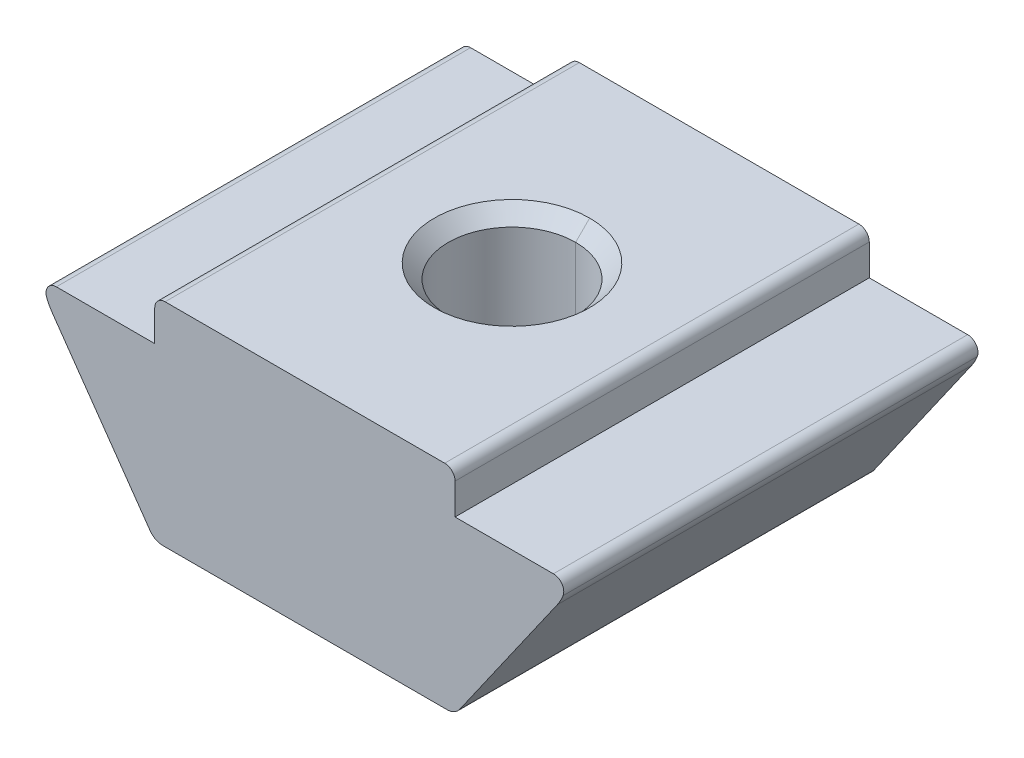
ISO-10303-21;
HEADER;
FILE_DESCRIPTION(('STEP AP214'),'2;1');
FILE_NAME('part.step','',(''),(''),'','','');
FILE_SCHEMA(('AUTOMOTIVE_DESIGN { 1 0 10303 214 1 1 1 1 }'));
ENDSEC;
DATA;
#1=APPLICATION_CONTEXT('core data for automotive mechanical design processes');
#2=APPLICATION_PROTOCOL_DEFINITION('international standard','automotive_design',2000,#1);
#3=PRODUCT_CONTEXT('',#1,'mechanical');
#4=PRODUCT('Part','Part','',(#3));
#5=PRODUCT_RELATED_PRODUCT_CATEGORY('part','',(#4));
#6=PRODUCT_DEFINITION_FORMATION('','',#4);
#7=PRODUCT_DEFINITION_CONTEXT('part definition',#1,'design');
#8=PRODUCT_DEFINITION('design','',#6,#7);
#9=PRODUCT_DEFINITION_SHAPE('','',#8);
#10=(LENGTH_UNIT() NAMED_UNIT(*) SI_UNIT(.MILLI.,.METRE.));
#11=(NAMED_UNIT(*) PLANE_ANGLE_UNIT() SI_UNIT($,.RADIAN.));
#12=(NAMED_UNIT(*) SI_UNIT($,.STERADIAN.) SOLID_ANGLE_UNIT());
#13=UNCERTAINTY_MEASURE_WITH_UNIT(LENGTH_MEASURE(1.E-05),#10,'distance_accuracy_value','');
#14=(GEOMETRIC_REPRESENTATION_CONTEXT(3) GLOBAL_UNCERTAINTY_ASSIGNED_CONTEXT((#13)) GLOBAL_UNIT_ASSIGNED_CONTEXT((#10,
#11,#12)) REPRESENTATION_CONTEXT('',''));
#15=CARTESIAN_POINT('',(0.,0.,0.));
#16=DIRECTION('',(0.,0.,1.));
#17=DIRECTION('',(1.,0.,0.));
#18=AXIS2_PLACEMENT_3D('',#15,#16,#17);
#19=CARTESIAN_POINT('',(-2.9,3.3,8.));
#20=DIRECTION('',(0.,-1.,0.));
#21=DIRECTION('',(0.,0.,-1.));
#22=AXIS2_PLACEMENT_3D('',#19,#20,#21);
#23=PLANE('',#22);
#24=DIRECTION('',(-1.,0.,0.));
#25=VECTOR('',#24,1.);
#26=CARTESIAN_POINT('',(-2.9,3.3,0.));
#27=LINE('',#26,#25);
#28=CARTESIAN_POINT('',(-2.9,3.3,0.));
#29=VERTEX_POINT('',#28);
#30=CARTESIAN_POINT('',(-4.7998662157511,3.3,0.));
#31=VERTEX_POINT('',#30);
#32=EDGE_CURVE('E11',#29,#31,#27,.T.);
#33=ORIENTED_EDGE('',*,*,#32,.T.);
#34=DIRECTION('',(0.,0.,-1.));
#35=VECTOR('',#34,1.);
#36=CARTESIAN_POINT('',(-4.7998662157511,3.3,8.));
#37=LINE('',#36,#35);
#38=CARTESIAN_POINT('',(-4.7998662157511,3.3,8.));
#39=VERTEX_POINT('',#38);
#40=EDGE_CURVE('E25',#39,#31,#37,.T.);
#41=ORIENTED_EDGE('',*,*,#40,.F.);
#42=DIRECTION('',(-1.,0.,0.));
#43=VECTOR('',#42,1.);
#44=CARTESIAN_POINT('',(-2.9,3.3,8.));
#45=LINE('',#44,#43);
#46=CARTESIAN_POINT('',(-2.9,3.3,8.));
#47=VERTEX_POINT('',#46);
#48=EDGE_CURVE('E407',#47,#39,#45,.T.);
#49=ORIENTED_EDGE('',*,*,#48,.F.);
#50=DIRECTION('',(0.,0.,-1.));
#51=VECTOR('',#50,1.);
#52=CARTESIAN_POINT('',(-2.9,3.3,8.));
#53=LINE('',#52,#51);
#54=EDGE_CURVE('E403',#47,#29,#53,.T.);
#55=ORIENTED_EDGE('',*,*,#54,.T.);
#56=EDGE_LOOP('',(#33,#41,#49,#55));
#57=FACE_BOUND('',#56,.T.);
#58=ADVANCED_FACE('F17',(#57),#23,.F.);
#59=CARTESIAN_POINT('',(-2.9,3.9,8.));
#60=DIRECTION('',(1.,0.,0.));
#61=DIRECTION('',(0.,0.,-1.));
#62=AXIS2_PLACEMENT_3D('',#59,#60,#61);
#63=PLANE('',#62);
#64=DIRECTION('',(0.,-1.,0.));
#65=VECTOR('',#64,1.);
#66=CARTESIAN_POINT('',(-2.9,3.9,0.));
#67=LINE('',#66,#65);
#68=CARTESIAN_POINT('',(-2.9,3.9,0.));
#69=VERTEX_POINT('',#68);
#70=EDGE_CURVE('E398',#69,#29,#67,.T.);
#71=ORIENTED_EDGE('',*,*,#70,.T.);
#72=ORIENTED_EDGE('',*,*,#54,.F.);
#73=DIRECTION('',(0.,-1.,0.));
#74=VECTOR('',#73,1.);
#75=CARTESIAN_POINT('',(-2.9,3.9,8.));
#76=LINE('',#75,#74);
#77=CARTESIAN_POINT('',(-2.9,3.9,8.));
#78=VERTEX_POINT('',#77);
#79=EDGE_CURVE('E393',#78,#47,#76,.T.);
#80=ORIENTED_EDGE('',*,*,#79,.F.);
#81=DIRECTION('',(0.,0.,-1.));
#82=VECTOR('',#81,1.);
#83=CARTESIAN_POINT('',(-2.9,3.9,8.));
#84=LINE('',#83,#82);
#85=EDGE_CURVE('E389',#78,#69,#84,.T.);
#86=ORIENTED_EDGE('',*,*,#85,.T.);
#87=EDGE_LOOP('',(#71,#72,#80,#86));
#88=FACE_BOUND('',#87,.T.);
#89=ADVANCED_FACE('F424',(#88),#63,.F.);
#90=CARTESIAN_POINT('',(-2.7,3.9,8.));
#91=DIRECTION('',(0.,0.,-1.));
#92=DIRECTION('',(0.707106781186548,-0.707106781186547,0.));
#93=AXIS2_PLACEMENT_3D('',#90,#91,#92);
#94=CYLINDRICAL_SURFACE('',#93,0.20000000000003);
#95=CARTESIAN_POINT('',(-2.7,3.9,0.));
#96=DIRECTION('',(0.,0.,1.));
#97=DIRECTION('',(1.,0.,0.));
#98=AXIS2_PLACEMENT_3D('',#95,#96,#97);
#99=CIRCLE('',#98,0.20000000000003);
#100=CARTESIAN_POINT('',(-2.7,4.1,0.));
#101=VERTEX_POINT('',#100);
#102=EDGE_CURVE('E384',#101,#69,#99,.T.);
#103=ORIENTED_EDGE('',*,*,#102,.T.);
#104=ORIENTED_EDGE('',*,*,#85,.F.);
#105=CARTESIAN_POINT('',(-2.7,3.9,8.));
#106=DIRECTION('',(0.,0.,1.));
#107=DIRECTION('',(1.,0.,0.));
#108=AXIS2_PLACEMENT_3D('',#105,#106,#107);
#109=CIRCLE('',#108,0.20000000000003);
#110=CARTESIAN_POINT('',(-2.7,4.1,8.));
#111=VERTEX_POINT('',#110);
#112=EDGE_CURVE('E379',#111,#78,#109,.T.);
#113=ORIENTED_EDGE('',*,*,#112,.F.);
#114=DIRECTION('',(0.,0.,-1.));
#115=VECTOR('',#114,1.);
#116=CARTESIAN_POINT('',(-2.7,4.1,8.));
#117=LINE('',#116,#115);
#118=EDGE_CURVE('E375',#111,#101,#117,.T.);
#119=ORIENTED_EDGE('',*,*,#118,.T.);
#120=EDGE_LOOP('',(#103,#104,#113,#119));
#121=FACE_BOUND('',#120,.T.);
#122=ADVANCED_FACE('F478',(#121),#94,.T.);
#123=CARTESIAN_POINT('',(2.7,4.1,8.));
#124=DIRECTION('',(0.,-1.,0.));
#125=DIRECTION('',(0.,0.,-1.));
#126=AXIS2_PLACEMENT_3D('',#123,#124,#125);
#127=PLANE('',#126);
#128=CARTESIAN_POINT('',(0.,4.1,4.));
#129=DIRECTION('',(0.,1.,0.));
#130=DIRECTION('',(0.,0.,1.));
#131=AXIS2_PLACEMENT_3D('',#128,#129,#130);
#132=CIRCLE('',#131,1.5);
#133=CARTESIAN_POINT('',(0.,4.1,2.5));
#134=VERTEX_POINT('',#133);
#135=CARTESIAN_POINT('',(0.,4.1,5.5));
#136=VERTEX_POINT('',#135);
#137=EDGE_CURVE('E161',#134,#136,#132,.T.);
#138=ORIENTED_EDGE('',*,*,#137,.F.);
#139=CARTESIAN_POINT('',(0.,4.1,4.));
#140=DIRECTION('',(0.,1.,0.));
#141=DIRECTION('',(0.,0.,1.));
#142=AXIS2_PLACEMENT_3D('',#139,#140,#141);
#143=CIRCLE('',#142,1.5);
#144=EDGE_CURVE('E368',#136,#134,#143,.T.);
#145=ORIENTED_EDGE('',*,*,#144,.F.);
#146=EDGE_LOOP('',(#138,#145));
#147=FACE_BOUND('',#146,.T.);
#148=DIRECTION('',(-1.,0.,0.));
#149=VECTOR('',#148,1.);
#150=CARTESIAN_POINT('',(2.7,4.1,0.));
#151=LINE('',#150,#149);
#152=CARTESIAN_POINT('',(2.7,4.1,0.));
#153=VERTEX_POINT('',#152);
#154=EDGE_CURVE('E363',#153,#101,#151,.T.);
#155=ORIENTED_EDGE('',*,*,#154,.T.);
#156=ORIENTED_EDGE('',*,*,#118,.F.);
#157=DIRECTION('',(-1.,0.,0.));
#158=VECTOR('',#157,1.);
#159=CARTESIAN_POINT('',(2.7,4.1,8.));
#160=LINE('',#159,#158);
#161=CARTESIAN_POINT('',(2.7,4.1,8.));
#162=VERTEX_POINT('',#161);
#163=EDGE_CURVE('E358',#162,#111,#160,.T.);
#164=ORIENTED_EDGE('',*,*,#163,.F.);
#165=DIRECTION('',(0.,0.,-1.));
#166=VECTOR('',#165,1.);
#167=CARTESIAN_POINT('',(2.7,4.1,8.));
#168=LINE('',#167,#166);
#169=EDGE_CURVE('E354',#162,#153,#168,.T.);
#170=ORIENTED_EDGE('',*,*,#169,.T.);
#171=EDGE_LOOP('',(#155,#156,#164,#170));
#172=FACE_BOUND('',#171,.T.);
#173=ADVANCED_FACE('F475',(#147,#172),#127,.F.);
#174=CARTESIAN_POINT('',(2.7,3.9,8.));
#175=DIRECTION('',(0.,0.,-1.));
#176=DIRECTION('',(-0.707106781186548,-0.707106781186547,0.));
#177=AXIS2_PLACEMENT_3D('',#174,#175,#176);
#178=CYLINDRICAL_SURFACE('',#177,0.200000000000031);
#179=CARTESIAN_POINT('',(2.7,3.9,0.));
#180=DIRECTION('',(0.,0.,1.));
#181=DIRECTION('',(1.,0.,0.));
#182=AXIS2_PLACEMENT_3D('',#179,#180,#181);
#183=CIRCLE('',#182,0.200000000000031);
#184=CARTESIAN_POINT('',(2.9,3.9,0.));
#185=VERTEX_POINT('',#184);
#186=EDGE_CURVE('E349',#185,#153,#183,.T.);
#187=ORIENTED_EDGE('',*,*,#186,.T.);
#188=ORIENTED_EDGE('',*,*,#169,.F.);
#189=CARTESIAN_POINT('',(2.7,3.9,8.));
#190=DIRECTION('',(0.,0.,1.));
#191=DIRECTION('',(1.,0.,0.));
#192=AXIS2_PLACEMENT_3D('',#189,#190,#191);
#193=CIRCLE('',#192,0.200000000000031);
#194=CARTESIAN_POINT('',(2.9,3.9,8.));
#195=VERTEX_POINT('',#194);
#196=EDGE_CURVE('E344',#195,#162,#193,.T.);
#197=ORIENTED_EDGE('',*,*,#196,.F.);
#198=DIRECTION('',(0.,0.,-1.));
#199=VECTOR('',#198,1.);
#200=CARTESIAN_POINT('',(2.9,3.9,8.));
#201=LINE('',#200,#199);
#202=EDGE_CURVE('E340',#195,#185,#201,.T.);
#203=ORIENTED_EDGE('',*,*,#202,.T.);
#204=EDGE_LOOP('',(#187,#188,#197,#203));
#205=FACE_BOUND('',#204,.T.);
#206=ADVANCED_FACE('F472',(#205),#178,.T.);
#207=CARTESIAN_POINT('',(2.9,3.3,8.));
#208=DIRECTION('',(-1.,0.,0.));
#209=DIRECTION('',(0.,0.,1.));
#210=AXIS2_PLACEMENT_3D('',#207,#208,#209);
#211=PLANE('',#210);
#212=DIRECTION('',(0.,1.,0.));
#213=VECTOR('',#212,1.);
#214=CARTESIAN_POINT('',(2.9,3.3,0.));
#215=LINE('',#214,#213);
#216=CARTESIAN_POINT('',(2.9,3.3,0.));
#217=VERTEX_POINT('',#216);
#218=EDGE_CURVE('E335',#217,#185,#215,.T.);
#219=ORIENTED_EDGE('',*,*,#218,.T.);
#220=ORIENTED_EDGE('',*,*,#202,.F.);
#221=DIRECTION('',(0.,1.,0.));
#222=VECTOR('',#221,1.);
#223=CARTESIAN_POINT('',(2.9,3.3,8.));
#224=LINE('',#223,#222);
#225=CARTESIAN_POINT('',(2.9,3.3,8.));
#226=VERTEX_POINT('',#225);
#227=EDGE_CURVE('E330',#226,#195,#224,.T.);
#228=ORIENTED_EDGE('',*,*,#227,.F.);
#229=DIRECTION('',(0.,0.,-1.));
#230=VECTOR('',#229,1.);
#231=CARTESIAN_POINT('',(2.9,3.3,8.));
#232=LINE('',#231,#230);
#233=EDGE_CURVE('E326',#226,#217,#232,.T.);
#234=ORIENTED_EDGE('',*,*,#233,.T.);
#235=EDGE_LOOP('',(#219,#220,#228,#234));
#236=FACE_BOUND('',#235,.T.);
#237=ADVANCED_FACE('F467',(#236),#211,.F.);
#238=CARTESIAN_POINT('',(4.7998662157511,3.3,8.));
#239=DIRECTION('',(0.,-1.,0.));
#240=DIRECTION('',(0.,0.,-1.));
#241=AXIS2_PLACEMENT_3D('',#238,#239,#240);
#242=PLANE('',#241);
#243=DIRECTION('',(-1.,0.,0.));
#244=VECTOR('',#243,1.);
#245=CARTESIAN_POINT('',(4.7998662157511,3.3,0.));
#246=LINE('',#245,#244);
#247=CARTESIAN_POINT('',(4.7998662157511,3.3,0.));
#248=VERTEX_POINT('',#247);
#249=EDGE_CURVE('E321',#248,#217,#246,.T.);
#250=ORIENTED_EDGE('',*,*,#249,.T.);
#251=ORIENTED_EDGE('',*,*,#233,.F.);
#252=DIRECTION('',(-1.,0.,0.));
#253=VECTOR('',#252,1.);
#254=CARTESIAN_POINT('',(4.7998662157511,3.3,8.));
#255=LINE('',#254,#253);
#256=CARTESIAN_POINT('',(4.7998662157511,3.3,8.));
#257=VERTEX_POINT('',#256);
#258=EDGE_CURVE('E316',#257,#226,#255,.T.);
#259=ORIENTED_EDGE('',*,*,#258,.F.);
#260=DIRECTION('',(0.,0.,-1.));
#261=VECTOR('',#260,1.);
#262=CARTESIAN_POINT('',(4.7998662157511,3.3,8.));
#263=LINE('',#262,#261);
#264=EDGE_CURVE('E312',#257,#248,#263,.T.);
#265=ORIENTED_EDGE('',*,*,#264,.T.);
#266=EDGE_LOOP('',(#250,#251,#259,#265));
#267=FACE_BOUND('',#266,.T.);
#268=ADVANCED_FACE('F463',(#267),#242,.F.);
#269=CARTESIAN_POINT('',(4.7998662157511,3.10000000000006,8.));
#270=DIRECTION('',(0.,0.,-1.));
#271=DIRECTION('',(-0.827037597866269,-0.562146610516858,0.));
#272=AXIS2_PLACEMENT_3D('',#269,#270,#271);
#273=CYLINDRICAL_SURFACE('',#272,0.199999999999944);
#274=CARTESIAN_POINT('',(4.7998662157511,3.10000000000006,0.));
#275=DIRECTION('',(0.,0.,1.));
#276=DIRECTION('',(1.,0.,0.));
#277=AXIS2_PLACEMENT_3D('',#274,#275,#276);
#278=CIRCLE('',#277,0.199999999999944);
#279=CARTESIAN_POINT('',(4.9858327696888,3.0264035271463,0.));
#280=VERTEX_POINT('',#279);
#281=EDGE_CURVE('E307',#280,#248,#278,.T.);
#282=ORIENTED_EDGE('',*,*,#281,.T.);
#283=ORIENTED_EDGE('',*,*,#264,.F.);
#284=CARTESIAN_POINT('',(4.7998662157511,3.10000000000006,8.));
#285=DIRECTION('',(0.,0.,1.));
#286=DIRECTION('',(1.,0.,0.));
#287=AXIS2_PLACEMENT_3D('',#284,#285,#286);
#288=CIRCLE('',#287,0.199999999999944);
#289=CARTESIAN_POINT('',(4.9858327696888,3.0264035271463,8.));
#290=VERTEX_POINT('',#289);
#291=EDGE_CURVE('E302',#290,#257,#288,.T.);
#292=ORIENTED_EDGE('',*,*,#291,.F.);
#293=DIRECTION('',(0.,0.,-1.));
#294=VECTOR('',#293,1.);
#295=CARTESIAN_POINT('',(4.9858327696888,3.0264035271463,8.));
#296=LINE('',#295,#294);
#297=EDGE_CURVE('E298',#290,#280,#296,.T.);
#298=ORIENTED_EDGE('',*,*,#297,.T.);
#299=EDGE_LOOP('',(#282,#283,#292,#298));
#300=FACE_BOUND('',#299,.T.);
#301=ADVANCED_FACE('F460',(#300),#273,.T.);
#302=CARTESIAN_POINT('',(4.05600000000028,3.39438589141449,8.));
#303=DIRECTION('',(0.,0.,-1.));
#304=DIRECTION('',(-0.880513596901839,0.474020891597602,0.));
#305=AXIS2_PLACEMENT_3D('',#302,#303,#304);
#306=CYLINDRICAL_SURFACE('',#305,0.999999999999519);
#307=CARTESIAN_POINT('',(4.05600000000028,3.39438589141449,0.));
#308=DIRECTION('',(0.,0.,1.));
#309=DIRECTION('',(1.,0.,0.));
#310=AXIS2_PLACEMENT_3D('',#307,#308,#309);
#311=CIRCLE('',#310,0.999999999999519);
#312=CARTESIAN_POINT('',(4.875152044289,2.8208094550639,0.));
#313=VERTEX_POINT('',#312);
#314=EDGE_CURVE('E293',#313,#280,#311,.T.);
#315=ORIENTED_EDGE('',*,*,#314,.T.);
#316=ORIENTED_EDGE('',*,*,#297,.F.);
#317=CARTESIAN_POINT('',(4.05600000000028,3.39438589141449,8.));
#318=DIRECTION('',(0.,0.,1.));
#319=DIRECTION('',(1.,0.,0.));
#320=AXIS2_PLACEMENT_3D('',#317,#318,#319);
#321=CIRCLE('',#320,0.999999999999519);
#322=CARTESIAN_POINT('',(4.875152044289,2.8208094550639,8.));
#323=VERTEX_POINT('',#322);
#324=EDGE_CURVE('E288',#323,#290,#321,.T.);
#325=ORIENTED_EDGE('',*,*,#324,.F.);
#326=DIRECTION('',(0.,0.,-1.));
#327=VECTOR('',#326,1.);
#328=CARTESIAN_POINT('',(4.875152044289,2.8208094550639,8.));
#329=LINE('',#328,#327);
#330=EDGE_CURVE('E284',#323,#313,#329,.T.);
#331=ORIENTED_EDGE('',*,*,#330,.T.);
#332=EDGE_LOOP('',(#315,#316,#325,#331));
#333=FACE_BOUND('',#332,.T.);
#334=ADVANCED_FACE('F455',(#333),#306,.T.);
#335=CARTESIAN_POINT('',(2.9895754981212,0.12792706909469,8.));
#336=DIRECTION('',(-0.819152044288991,0.573576436351048,0.));
#337=DIRECTION('',(-0.573576436351048,-0.819152044288991,0.));
#338=AXIS2_PLACEMENT_3D('',#335,#336,#337);
#339=PLANE('',#338);
#340=DIRECTION('',(0.573576436351048,0.81915204428899,0.));
#341=VECTOR('',#340,1.);
#342=CARTESIAN_POINT('',(2.9895754981212,0.12792706909469,0.));
#343=LINE('',#342,#341);
#344=CARTESIAN_POINT('',(2.9895754981212,0.12792706909469,0.));
#345=VERTEX_POINT('',#344);
#346=EDGE_CURVE('E279',#345,#313,#343,.T.);
#347=ORIENTED_EDGE('',*,*,#346,.T.);
#348=ORIENTED_EDGE('',*,*,#330,.F.);
#349=DIRECTION('',(0.573576436351048,0.81915204428899,0.));
#350=VECTOR('',#349,1.);
#351=CARTESIAN_POINT('',(2.9895754981212,0.12792706909469,8.));
#352=LINE('',#351,#350);
#353=CARTESIAN_POINT('',(2.9895754981212,0.12792706909469,8.));
#354=VERTEX_POINT('',#353);
#355=EDGE_CURVE('E274',#354,#323,#352,.T.);
#356=ORIENTED_EDGE('',*,*,#355,.F.);
#357=DIRECTION('',(0.,0.,-1.));
#358=VECTOR('',#357,1.);
#359=CARTESIAN_POINT('',(2.9895754981212,0.12792706909469,8.));
#360=LINE('',#359,#358);
#361=EDGE_CURVE('E270',#354,#345,#360,.T.);
#362=ORIENTED_EDGE('',*,*,#361,.T.);
#363=EDGE_LOOP('',(#347,#348,#356,#362));
#364=FACE_BOUND('',#363,.T.);
#365=ADVANCED_FACE('F452',(#364),#339,.F.);
#366=CARTESIAN_POINT('',(2.74382988483448,0.300000000000038,8.));
#367=DIRECTION('',(0.,0.,-1.));
#368=DIRECTION('',(-0.461748613235041,0.887010833178218,0.));
#369=AXIS2_PLACEMENT_3D('',#366,#367,#368);
#370=CYLINDRICAL_SURFACE('',#369,0.300000000000038);
#371=CARTESIAN_POINT('',(2.74382988483448,0.300000000000038,0.));
#372=DIRECTION('',(0.,0.,1.));
#373=DIRECTION('',(1.,0.,0.));
#374=AXIS2_PLACEMENT_3D('',#371,#372,#373);
#375=CIRCLE('',#374,0.300000000000038);
#376=CARTESIAN_POINT('',(2.7438298848345,0.,0.));
#377=VERTEX_POINT('',#376);
#378=EDGE_CURVE('E265',#377,#345,#375,.T.);
#379=ORIENTED_EDGE('',*,*,#378,.T.);
#380=ORIENTED_EDGE('',*,*,#361,.F.);
#381=CARTESIAN_POINT('',(2.74382988483448,0.300000000000038,8.));
#382=DIRECTION('',(0.,0.,1.));
#383=DIRECTION('',(1.,0.,0.));
#384=AXIS2_PLACEMENT_3D('',#381,#382,#383);
#385=CIRCLE('',#384,0.300000000000038);
#386=CARTESIAN_POINT('',(2.7438298848345,0.,8.));
#387=VERTEX_POINT('',#386);
#388=EDGE_CURVE('E260',#387,#354,#385,.T.);
#389=ORIENTED_EDGE('',*,*,#388,.F.);
#390=DIRECTION('',(0.,0.,-1.));
#391=VECTOR('',#390,1.);
#392=CARTESIAN_POINT('',(2.7438298848345,0.,8.));
#393=LINE('',#392,#391);
#394=EDGE_CURVE('E256',#387,#377,#393,.T.);
#395=ORIENTED_EDGE('',*,*,#394,.T.);
#396=EDGE_LOOP('',(#379,#380,#389,#395));
#397=FACE_BOUND('',#396,.T.);
#398=ADVANCED_FACE('F449',(#397),#370,.T.);
#399=CARTESIAN_POINT('',(-2.7438298848345,0.,8.));
#400=DIRECTION('',(0.,1.,0.));
#401=DIRECTION('',(0.,0.,1.));
#402=AXIS2_PLACEMENT_3D('',#399,#400,#401);
#403=PLANE('',#402);
#404=CARTESIAN_POINT('',(0.,0.,4.));
#405=DIRECTION('',(0.,1.,0.));
#406=DIRECTION('',(0.,0.,1.));
#407=AXIS2_PLACEMENT_3D('',#404,#405,#406);
#408=CIRCLE('',#407,1.2295);
#409=CARTESIAN_POINT('',(0.,0.,5.2295));
#410=VERTEX_POINT('',#409);
#411=CARTESIAN_POINT('',(0.,0.,2.7705));
#412=VERTEX_POINT('',#411);
#413=EDGE_CURVE('E173',#410,#412,#408,.T.);
#414=ORIENTED_EDGE('',*,*,#413,.T.);
#415=CARTESIAN_POINT('',(0.,0.,4.));
#416=DIRECTION('',(0.,1.,0.));
#417=DIRECTION('',(0.,0.,1.));
#418=AXIS2_PLACEMENT_3D('',#415,#416,#417);
#419=CIRCLE('',#418,1.2295);
#420=EDGE_CURVE('E249',#412,#410,#419,.T.);
#421=ORIENTED_EDGE('',*,*,#420,.T.);
#422=EDGE_LOOP('',(#414,#421));
#423=FACE_BOUND('',#422,.T.);
#424=DIRECTION('',(1.,0.,0.));
#425=VECTOR('',#424,1.);
#426=CARTESIAN_POINT('',(-2.7438298848345,0.,0.));
#427=LINE('',#426,#425);
#428=CARTESIAN_POINT('',(-2.7438298848345,0.,0.));
#429=VERTEX_POINT('',#428);
#430=EDGE_CURVE('E244',#429,#377,#427,.T.);
#431=ORIENTED_EDGE('',*,*,#430,.T.);
#432=ORIENTED_EDGE('',*,*,#394,.F.);
#433=DIRECTION('',(1.,0.,0.));
#434=VECTOR('',#433,1.);
#435=CARTESIAN_POINT('',(-2.7438298848345,0.,8.));
#436=LINE('',#435,#434);
#437=CARTESIAN_POINT('',(-2.7438298848345,0.,8.));
#438=VERTEX_POINT('',#437);
#439=EDGE_CURVE('E239',#438,#387,#436,.T.);
#440=ORIENTED_EDGE('',*,*,#439,.F.);
#441=DIRECTION('',(0.,0.,-1.));
#442=VECTOR('',#441,1.);
#443=CARTESIAN_POINT('',(-2.7438298848345,0.,8.));
#444=LINE('',#443,#442);
#445=EDGE_CURVE('E235',#438,#429,#444,.T.);
#446=ORIENTED_EDGE('',*,*,#445,.T.);
#447=EDGE_LOOP('',(#431,#432,#440,#446));
#448=FACE_BOUND('',#447,.T.);
#449=ADVANCED_FACE('F443',(#423,#448),#403,.F.);
#450=CARTESIAN_POINT('',(-2.74382988483449,0.300000000000032,8.));
#451=DIRECTION('',(0.,0.,-1.));
#452=DIRECTION('',(0.461748613235037,0.88701083317822,0.));
#453=AXIS2_PLACEMENT_3D('',#450,#451,#452);
#454=CYLINDRICAL_SURFACE('',#453,0.300000000000032);
#455=CARTESIAN_POINT('',(-2.74382988483449,0.300000000000032,0.));
#456=DIRECTION('',(0.,0.,1.));
#457=DIRECTION('',(1.,0.,0.));
#458=AXIS2_PLACEMENT_3D('',#455,#456,#457);
#459=CIRCLE('',#458,0.300000000000032);
#460=CARTESIAN_POINT('',(-2.9895754981212,0.12792706909469,0.));
#461=VERTEX_POINT('',#460);
#462=EDGE_CURVE('E230',#461,#429,#459,.T.);
#463=ORIENTED_EDGE('',*,*,#462,.T.);
#464=ORIENTED_EDGE('',*,*,#445,.F.);
#465=CARTESIAN_POINT('',(-2.74382988483449,0.300000000000032,8.));
#466=DIRECTION('',(0.,0.,1.));
#467=DIRECTION('',(1.,0.,0.));
#468=AXIS2_PLACEMENT_3D('',#465,#466,#467);
#469=CIRCLE('',#468,0.300000000000032);
#470=CARTESIAN_POINT('',(-2.9895754981212,0.12792706909469,8.));
#471=VERTEX_POINT('',#470);
#472=EDGE_CURVE('E225',#471,#438,#469,.T.);
#473=ORIENTED_EDGE('',*,*,#472,.F.);
#474=DIRECTION('',(0.,0.,-1.));
#475=VECTOR('',#474,1.);
#476=CARTESIAN_POINT('',(-2.9895754981212,0.12792706909469,8.));
#477=LINE('',#476,#475);
#478=EDGE_CURVE('E221',#471,#461,#477,.T.);
#479=ORIENTED_EDGE('',*,*,#478,.T.);
#480=EDGE_LOOP('',(#463,#464,#473,#479));
#481=FACE_BOUND('',#480,.T.);
#482=ADVANCED_FACE('F440',(#481),#454,.T.);
#483=CARTESIAN_POINT('',(-4.875152044289,2.8208094550639,8.));
#484=DIRECTION('',(0.819152044288991,0.573576436351048,0.));
#485=DIRECTION('',(-0.573576436351048,0.819152044288991,0.));
#486=AXIS2_PLACEMENT_3D('',#483,#484,#485);
#487=PLANE('',#486);
#488=DIRECTION('',(0.573576436351048,-0.81915204428899,0.));
#489=VECTOR('',#488,1.);
#490=CARTESIAN_POINT('',(-4.875152044289,2.8208094550639,0.));
#491=LINE('',#490,#489);
#492=CARTESIAN_POINT('',(-4.875152044289,2.8208094550639,0.));
#493=VERTEX_POINT('',#492);
#494=EDGE_CURVE('E216',#493,#461,#491,.T.);
#495=ORIENTED_EDGE('',*,*,#494,.T.);
#496=ORIENTED_EDGE('',*,*,#478,.F.);
#497=DIRECTION('',(0.573576436351048,-0.81915204428899,0.));
#498=VECTOR('',#497,1.);
#499=CARTESIAN_POINT('',(-4.875152044289,2.8208094550639,8.));
#500=LINE('',#499,#498);
#501=CARTESIAN_POINT('',(-4.875152044289,2.8208094550639,8.));
#502=VERTEX_POINT('',#501);
#503=EDGE_CURVE('E211',#502,#471,#500,.T.);
#504=ORIENTED_EDGE('',*,*,#503,.F.);
#505=DIRECTION('',(0.,0.,-1.));
#506=VECTOR('',#505,1.);
#507=CARTESIAN_POINT('',(-4.875152044289,2.8208094550639,8.));
#508=LINE('',#507,#506);
#509=EDGE_CURVE('E207',#502,#493,#508,.T.);
#510=ORIENTED_EDGE('',*,*,#509,.T.);
#511=EDGE_LOOP('',(#495,#496,#504,#510));
#512=FACE_BOUND('',#511,.T.);
#513=ADVANCED_FACE('F438',(#512),#487,.F.);
#514=CARTESIAN_POINT('',(-4.05600000000028,3.39438589141449,8.));
#515=DIRECTION('',(0.,0.,-1.));
#516=DIRECTION('',(0.880513596901123,0.474020891598932,0.));
#517=AXIS2_PLACEMENT_3D('',#514,#515,#516);
#518=CYLINDRICAL_SURFACE('',#517,0.999999999999519);
#519=CARTESIAN_POINT('',(-4.05600000000028,3.39438589141449,0.));
#520=DIRECTION('',(0.,0.,1.));
#521=DIRECTION('',(1.,0.,0.));
#522=AXIS2_PLACEMENT_3D('',#519,#520,#521);
#523=CIRCLE('',#522,0.999999999999519);
#524=CARTESIAN_POINT('',(-4.9858327696888,3.0264035271463,0.));
#525=VERTEX_POINT('',#524);
#526=EDGE_CURVE('E202',#525,#493,#523,.T.);
#527=ORIENTED_EDGE('',*,*,#526,.T.);
#528=ORIENTED_EDGE('',*,*,#509,.F.);
#529=CARTESIAN_POINT('',(-4.05600000000028,3.39438589141449,8.));
#530=DIRECTION('',(0.,0.,1.));
#531=DIRECTION('',(1.,0.,0.));
#532=AXIS2_PLACEMENT_3D('',#529,#530,#531);
#533=CIRCLE('',#532,0.999999999999519);
#534=CARTESIAN_POINT('',(-4.9858327696888,3.0264035271463,8.));
#535=VERTEX_POINT('',#534);
#536=EDGE_CURVE('E197',#535,#502,#533,.T.);
#537=ORIENTED_EDGE('',*,*,#536,.F.);
#538=DIRECTION('',(0.,0.,-1.));
#539=VECTOR('',#538,1.);
#540=CARTESIAN_POINT('',(-4.9858327696888,3.0264035271463,8.));
#541=LINE('',#540,#539);
#542=EDGE_CURVE('E193',#535,#525,#541,.T.);
#543=ORIENTED_EDGE('',*,*,#542,.T.);
#544=EDGE_LOOP('',(#527,#528,#537,#543));
#545=FACE_BOUND('',#544,.T.);
#546=ADVANCED_FACE('F434',(#545),#518,.T.);
#547=CARTESIAN_POINT('',(-4.7998662157511,3.10000000000006,8.));
#548=DIRECTION('',(0.,0.,-1.));
#549=DIRECTION('',(0.82703759786627,-0.562146610516857,0.));
#550=AXIS2_PLACEMENT_3D('',#547,#548,#549);
#551=CYLINDRICAL_SURFACE('',#550,0.199999999999944);
#552=CARTESIAN_POINT('',(-4.7998662157511,3.10000000000006,0.));
#553=DIRECTION('',(0.,0.,1.));
#554=DIRECTION('',(1.,0.,0.));
#555=AXIS2_PLACEMENT_3D('',#552,#553,#554);
#556=CIRCLE('',#555,0.199999999999944);
#557=EDGE_CURVE('E188',#31,#525,#556,.T.);
#558=ORIENTED_EDGE('',*,*,#557,.T.);
#559=ORIENTED_EDGE('',*,*,#542,.F.);
#560=CARTESIAN_POINT('',(-4.7998662157511,3.10000000000006,8.));
#561=DIRECTION('',(0.,0.,1.));
#562=DIRECTION('',(1.,0.,0.));
#563=AXIS2_PLACEMENT_3D('',#560,#561,#562);
#564=CIRCLE('',#563,0.199999999999944);
#565=EDGE_CURVE('E183',#39,#535,#564,.T.);
#566=ORIENTED_EDGE('',*,*,#565,.F.);
#567=ORIENTED_EDGE('',*,*,#40,.T.);
#568=EDGE_LOOP('',(#558,#559,#566,#567));
#569=FACE_BOUND('',#568,.T.);
#570=ADVANCED_FACE('F417',(#569),#551,.T.);
#571=CARTESIAN_POINT('',(-4.7998662157511,3.10000000000006,8.));
#572=DIRECTION('',(0.,0.,1.));
#573=DIRECTION('',(1.,0.,0.));
#574=AXIS2_PLACEMENT_3D('',#571,#572,#573);
#575=PLANE('',#574);
#576=ORIENTED_EDGE('',*,*,#48,.T.);
#577=ORIENTED_EDGE('',*,*,#565,.T.);
#578=ORIENTED_EDGE('',*,*,#536,.T.);
#579=ORIENTED_EDGE('',*,*,#503,.T.);
#580=ORIENTED_EDGE('',*,*,#472,.T.);
#581=ORIENTED_EDGE('',*,*,#439,.T.);
#582=ORIENTED_EDGE('',*,*,#388,.T.);
#583=ORIENTED_EDGE('',*,*,#355,.T.);
#584=ORIENTED_EDGE('',*,*,#324,.T.);
#585=ORIENTED_EDGE('',*,*,#291,.T.);
#586=ORIENTED_EDGE('',*,*,#258,.T.);
#587=ORIENTED_EDGE('',*,*,#227,.T.);
#588=ORIENTED_EDGE('',*,*,#196,.T.);
#589=ORIENTED_EDGE('',*,*,#163,.T.);
#590=ORIENTED_EDGE('',*,*,#112,.T.);
#591=ORIENTED_EDGE('',*,*,#79,.T.);
#592=EDGE_LOOP('',(#576,#577,#578,#579,#580,#581,#582,#583,#584,#585,#586,#587,#588,#589,#590,#591));
#593=FACE_BOUND('',#592,.T.);
#594=ADVANCED_FACE('F421',(#593),#575,.T.);
#595=CARTESIAN_POINT('',(-4.7998662157511,3.10000000000006,0.));
#596=DIRECTION('',(0.,0.,1.));
#597=DIRECTION('',(1.,0.,0.));
#598=AXIS2_PLACEMENT_3D('',#595,#596,#597);
#599=PLANE('',#598);
#600=ORIENTED_EDGE('',*,*,#32,.F.);
#601=ORIENTED_EDGE('',*,*,#70,.F.);
#602=ORIENTED_EDGE('',*,*,#102,.F.);
#603=ORIENTED_EDGE('',*,*,#154,.F.);
#604=ORIENTED_EDGE('',*,*,#186,.F.);
#605=ORIENTED_EDGE('',*,*,#218,.F.);
#606=ORIENTED_EDGE('',*,*,#249,.F.);
#607=ORIENTED_EDGE('',*,*,#281,.F.);
#608=ORIENTED_EDGE('',*,*,#314,.F.);
#609=ORIENTED_EDGE('',*,*,#346,.F.);
#610=ORIENTED_EDGE('',*,*,#378,.F.);
#611=ORIENTED_EDGE('',*,*,#430,.F.);
#612=ORIENTED_EDGE('',*,*,#462,.F.);
#613=ORIENTED_EDGE('',*,*,#494,.F.);
#614=ORIENTED_EDGE('',*,*,#526,.F.);
#615=ORIENTED_EDGE('',*,*,#557,.F.);
#616=EDGE_LOOP('',(#600,#601,#602,#603,#604,#605,#606,#607,#608,#609,#610,#611,#612,#613,#614,#615));
#617=FACE_BOUND('',#616,.T.);
#618=ADVANCED_FACE('F429',(#617),#599,.F.);
#619=CARTESIAN_POINT('',(0.,4.1,4.));
#620=DIRECTION('',(0.,1.,0.));
#621=DIRECTION('',(1.,0.,0.));
#622=AXIS2_PLACEMENT_3D('',#619,#620,#621);
#623=CYLINDRICAL_SURFACE('',#622,1.2295);
#624=DIRECTION('',(0.,1.,0.));
#625=VECTOR('',#624,1.);
#626=CARTESIAN_POINT('',(0.,0.,2.7705));
#627=LINE('',#626,#625);
#628=CARTESIAN_POINT('',(0.,3.8295,2.7705));
#629=VERTEX_POINT('',#628);
#630=EDGE_CURVE('E151',#412,#629,#627,.T.);
#631=ORIENTED_EDGE('',*,*,#630,.T.);
#632=CARTESIAN_POINT('',(0.,3.8295,4.));
#633=DIRECTION('',(0.,1.,0.));
#634=DIRECTION('',(0.,0.,1.));
#635=AXIS2_PLACEMENT_3D('',#632,#633,#634);
#636=CIRCLE('',#635,1.2295);
#637=CARTESIAN_POINT('',(0.,3.8295,5.2295));
#638=VERTEX_POINT('',#637);
#639=EDGE_CURVE('E144',#629,#638,#636,.T.);
#640=ORIENTED_EDGE('',*,*,#639,.T.);
#641=DIRECTION('',(0.,1.,0.));
#642=VECTOR('',#641,1.);
#643=CARTESIAN_POINT('',(0.,0.,5.2295));
#644=LINE('',#643,#642);
#645=EDGE_CURVE('E149',#410,#638,#644,.T.);
#646=ORIENTED_EDGE('',*,*,#645,.F.);
#647=ORIENTED_EDGE('',*,*,#420,.F.);
#648=EDGE_LOOP('',(#631,#640,#646,#647));
#649=FACE_BOUND('',#648,.T.);
#650=ADVANCED_FACE('F146',(#649),#623,.F.);
#651=CARTESIAN_POINT('',(0.,4.1,4.));
#652=DIRECTION('',(0.,1.,0.));
#653=DIRECTION('',(-1.,0.,0.));
#654=AXIS2_PLACEMENT_3D('',#651,#652,#653);
#655=CYLINDRICAL_SURFACE('',#654,1.2295);
#656=ORIENTED_EDGE('',*,*,#630,.F.);
#657=ORIENTED_EDGE('',*,*,#413,.F.);
#658=ORIENTED_EDGE('',*,*,#645,.T.);
#659=CARTESIAN_POINT('',(0.,3.8295,4.));
#660=DIRECTION('',(0.,1.,0.));
#661=DIRECTION('',(0.,0.,1.));
#662=AXIS2_PLACEMENT_3D('',#659,#660,#661);
#663=CIRCLE('',#662,1.2295);
#664=EDGE_CURVE('E167',#638,#629,#663,.T.);
#665=ORIENTED_EDGE('',*,*,#664,.T.);
#666=EDGE_LOOP('',(#656,#657,#658,#665));
#667=FACE_BOUND('',#666,.T.);
#668=ADVANCED_FACE('F172',(#667),#655,.F.);
#669=CARTESIAN_POINT('',(0.,3.8295,4.));
#670=DIRECTION('',(0.,1.,0.));
#671=DIRECTION('',(-1.,0.,0.));
#672=AXIS2_PLACEMENT_3D('',#669,#670,#671);
#673=CONICAL_SURFACE('',#672,1.2295,0.785398163397449);
#674=DIRECTION('',(0.,0.707106781186546,-0.707106781186549));
#675=VECTOR('',#674,1.);
#676=CARTESIAN_POINT('',(0.,3.8295,2.7705));
#677=LINE('',#676,#675);
#678=EDGE_CURVE('E164',#629,#134,#677,.T.);
#679=ORIENTED_EDGE('',*,*,#678,.F.);
#680=ORIENTED_EDGE('',*,*,#664,.F.);
#681=DIRECTION('',(0.,0.707106781186547,0.707106781186548));
#682=VECTOR('',#681,1.);
#683=CARTESIAN_POINT('',(0.,3.8295,5.2295));
#684=LINE('',#683,#682);
#685=EDGE_CURVE('E158',#638,#136,#684,.T.);
#686=ORIENTED_EDGE('',*,*,#685,.T.);
#687=ORIENTED_EDGE('',*,*,#144,.T.);
#688=EDGE_LOOP('',(#679,#680,#686,#687));
#689=FACE_BOUND('',#688,.T.);
#690=ADVANCED_FACE('F168',(#689),#673,.F.);
#691=CARTESIAN_POINT('',(0.,3.8295,4.));
#692=DIRECTION('',(0.,1.,0.));
#693=DIRECTION('',(1.,0.,0.));
#694=AXIS2_PLACEMENT_3D('',#691,#692,#693);
#695=CONICAL_SURFACE('',#694,1.2295,0.785398163397449);
#696=ORIENTED_EDGE('',*,*,#678,.T.);
#697=ORIENTED_EDGE('',*,*,#137,.T.);
#698=ORIENTED_EDGE('',*,*,#685,.F.);
#699=ORIENTED_EDGE('',*,*,#639,.F.);
#700=EDGE_LOOP('',(#696,#697,#698,#699));
#701=FACE_BOUND('',#700,.T.);
#702=ADVANCED_FACE('F160',(#701),#695,.F.);
#703=CLOSED_SHELL('',(#58,#89,#122,#173,#206,#237,#268,#301,#334,#365,#398,#449,#482,#513,#546,
#570,#594,#618,#650,#668,#690,#702));
#704=MANIFOLD_SOLID_BREP('B1',#703);
#705=ADVANCED_BREP_SHAPE_REPRESENTATION('',(#18,#704),#14);
#706=SHAPE_DEFINITION_REPRESENTATION(#9,#705);
ENDSEC;
END-ISO-10303-21;
